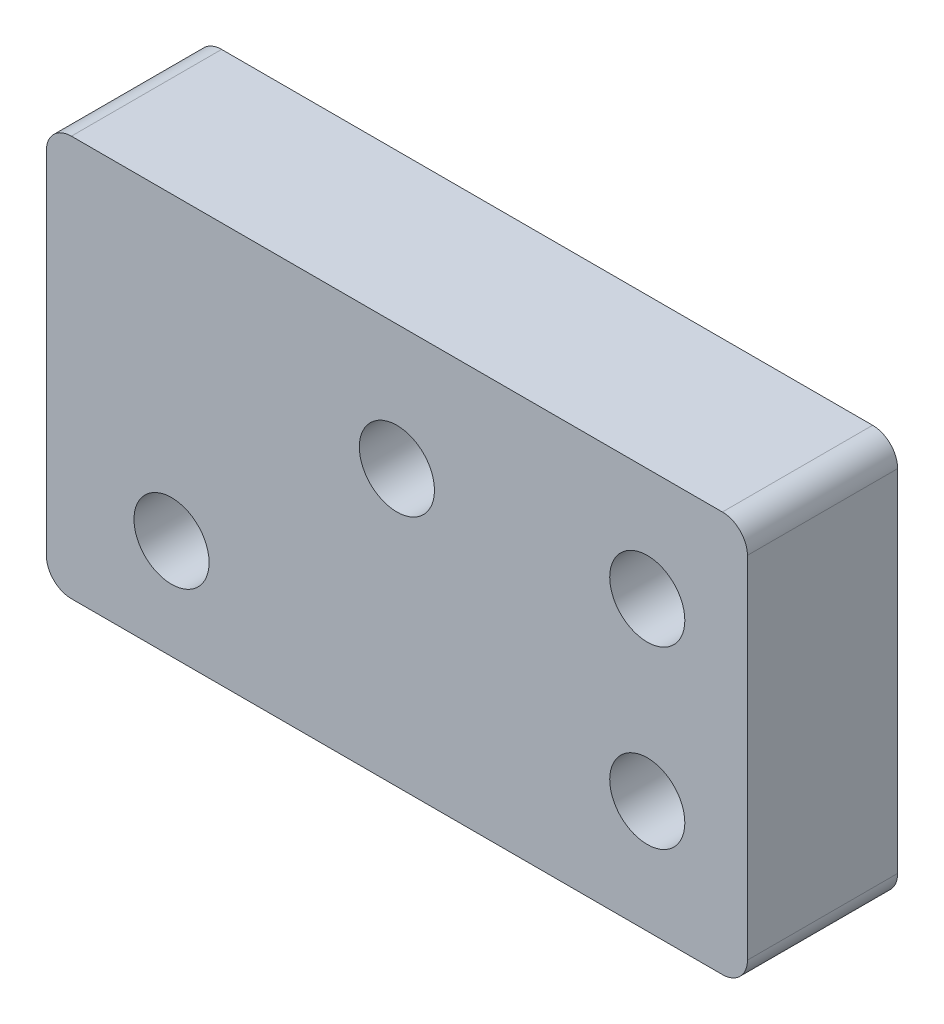
ISO-10303-21;
HEADER;
FILE_DESCRIPTION(('STEP AP214'),'2;1');
FILE_NAME('part.step','',(''),(''),'','','');
FILE_SCHEMA(('AUTOMOTIVE_DESIGN { 1 0 10303 214 1 1 1 1 }'));
ENDSEC;
DATA;
#1=APPLICATION_CONTEXT('core data for automotive mechanical design processes');
#2=APPLICATION_PROTOCOL_DEFINITION('international standard','automotive_design',2000,#1);
#3=PRODUCT_CONTEXT('',#1,'mechanical');
#4=PRODUCT('Part','Part','',(#3));
#5=PRODUCT_RELATED_PRODUCT_CATEGORY('part','',(#4));
#6=PRODUCT_DEFINITION_FORMATION('','',#4);
#7=PRODUCT_DEFINITION_CONTEXT('part definition',#1,'design');
#8=PRODUCT_DEFINITION('design','',#6,#7);
#9=PRODUCT_DEFINITION_SHAPE('','',#8);
#10=(LENGTH_UNIT() NAMED_UNIT(*) SI_UNIT(.MILLI.,.METRE.));
#11=(NAMED_UNIT(*) PLANE_ANGLE_UNIT() SI_UNIT($,.RADIAN.));
#12=(NAMED_UNIT(*) SI_UNIT($,.STERADIAN.) SOLID_ANGLE_UNIT());
#13=UNCERTAINTY_MEASURE_WITH_UNIT(LENGTH_MEASURE(1.E-05),#10,'distance_accuracy_value','');
#14=(GEOMETRIC_REPRESENTATION_CONTEXT(3) GLOBAL_UNCERTAINTY_ASSIGNED_CONTEXT((#13)) GLOBAL_UNIT_ASSIGNED_CONTEXT((#10,
#11,#12)) REPRESENTATION_CONTEXT('',''));
#15=CARTESIAN_POINT('',(0.,0.,0.));
#16=DIRECTION('',(0.,0.,1.));
#17=DIRECTION('',(1.,0.,0.));
#18=AXIS2_PLACEMENT_3D('',#15,#16,#17);
#19=CARTESIAN_POINT('',(-14.,-8.,6.));
#20=DIRECTION('',(1.,0.,0.));
#21=DIRECTION('',(0.,0.,-1.));
#22=AXIS2_PLACEMENT_3D('',#19,#20,#21);
#23=PLANE('',#22);
#24=DIRECTION('',(0.,-1.,0.));
#25=VECTOR('',#24,1.);
#26=CARTESIAN_POINT('',(-14.,-8.,6.));
#27=LINE('',#26,#25);
#28=CARTESIAN_POINT('',(-14.,7.,6.));
#29=VERTEX_POINT('',#28);
#30=CARTESIAN_POINT('',(-14.,-7.,6.));
#31=VERTEX_POINT('',#30);
#32=EDGE_CURVE('E123',#29,#31,#27,.T.);
#33=ORIENTED_EDGE('',*,*,#32,.F.);
#34=DIRECTION('',(0.,0.,-1.));
#35=VECTOR('',#34,1.);
#36=CARTESIAN_POINT('',(-14.,7.,6.));
#37=LINE('',#36,#35);
#38=CARTESIAN_POINT('',(-14.,7.,0.));
#39=VERTEX_POINT('',#38);
#40=EDGE_CURVE('E108',#29,#39,#37,.T.);
#41=ORIENTED_EDGE('',*,*,#40,.T.);
#42=DIRECTION('',(0.,-1.,0.));
#43=VECTOR('',#42,1.);
#44=CARTESIAN_POINT('',(-14.,-8.,0.));
#45=LINE('',#44,#43);
#46=CARTESIAN_POINT('',(-14.,-7.,0.));
#47=VERTEX_POINT('',#46);
#48=EDGE_CURVE('E120',#39,#47,#45,.T.);
#49=ORIENTED_EDGE('',*,*,#48,.T.);
#50=DIRECTION('',(0.,0.,-1.));
#51=VECTOR('',#50,1.);
#52=CARTESIAN_POINT('',(-14.,-7.,6.));
#53=LINE('',#52,#51);
#54=EDGE_CURVE('E126',#47,#31,#53,.F.);
#55=ORIENTED_EDGE('',*,*,#54,.T.);
#56=EDGE_LOOP('',(#33,#41,#49,#55));
#57=FACE_BOUND('',#56,.T.);
#58=ADVANCED_FACE('F36',(#57),#23,.F.);
#59=CARTESIAN_POINT('',(14.,-8.,6.));
#60=DIRECTION('',(0.,1.,0.));
#61=DIRECTION('',(-1.,0.,0.));
#62=AXIS2_PLACEMENT_3D('',#59,#60,#61);
#63=PLANE('',#62);
#64=DIRECTION('',(1.,0.,0.));
#65=VECTOR('',#64,1.);
#66=CARTESIAN_POINT('',(14.,-8.,6.));
#67=LINE('',#66,#65);
#68=CARTESIAN_POINT('',(-13.,-8.,6.));
#69=VERTEX_POINT('',#68);
#70=CARTESIAN_POINT('',(13.,-8.,6.));
#71=VERTEX_POINT('',#70);
#72=EDGE_CURVE('E208',#69,#71,#67,.T.);
#73=ORIENTED_EDGE('',*,*,#72,.F.);
#74=DIRECTION('',(0.,0.,-1.));
#75=VECTOR('',#74,1.);
#76=CARTESIAN_POINT('',(-13.,-8.,6.));
#77=LINE('',#76,#75);
#78=CARTESIAN_POINT('',(-13.,-8.,0.));
#79=VERTEX_POINT('',#78);
#80=EDGE_CURVE('E171',#69,#79,#77,.T.);
#81=ORIENTED_EDGE('',*,*,#80,.T.);
#82=DIRECTION('',(1.,0.,0.));
#83=VECTOR('',#82,1.);
#84=CARTESIAN_POINT('',(14.,-8.,0.));
#85=LINE('',#84,#83);
#86=CARTESIAN_POINT('',(13.,-8.,0.));
#87=VERTEX_POINT('',#86);
#88=EDGE_CURVE('E131',#79,#87,#85,.T.);
#89=ORIENTED_EDGE('',*,*,#88,.T.);
#90=DIRECTION('',(0.,0.,-1.));
#91=VECTOR('',#90,1.);
#92=CARTESIAN_POINT('',(13.,-8.,6.));
#93=LINE('',#92,#91);
#94=EDGE_CURVE('E169',#87,#71,#93,.F.);
#95=ORIENTED_EDGE('',*,*,#94,.T.);
#96=EDGE_LOOP('',(#73,#81,#89,#95));
#97=FACE_BOUND('',#96,.T.);
#98=ADVANCED_FACE('F227',(#97),#63,.F.);
#99=CARTESIAN_POINT('',(14.,-8.,6.));
#100=DIRECTION('',(-1.,0.,0.));
#101=DIRECTION('',(0.,0.,1.));
#102=AXIS2_PLACEMENT_3D('',#99,#100,#101);
#103=PLANE('',#102);
#104=DIRECTION('',(0.,1.,0.));
#105=VECTOR('',#104,1.);
#106=CARTESIAN_POINT('',(14.,-8.,6.));
#107=LINE('',#106,#105);
#108=CARTESIAN_POINT('',(14.,-7.,6.));
#109=VERTEX_POINT('',#108);
#110=CARTESIAN_POINT('',(14.,7.,6.));
#111=VERTEX_POINT('',#110);
#112=EDGE_CURVE('E210',#109,#111,#107,.T.);
#113=ORIENTED_EDGE('',*,*,#112,.F.);
#114=DIRECTION('',(0.,0.,-1.));
#115=VECTOR('',#114,1.);
#116=CARTESIAN_POINT('',(14.,-7.,6.));
#117=LINE('',#116,#115);
#118=CARTESIAN_POINT('',(14.,-7.,0.));
#119=VERTEX_POINT('',#118);
#120=EDGE_CURVE('E11',#109,#119,#117,.T.);
#121=ORIENTED_EDGE('',*,*,#120,.T.);
#122=DIRECTION('',(0.,1.,0.));
#123=VECTOR('',#122,1.);
#124=CARTESIAN_POINT('',(14.,-8.,0.));
#125=LINE('',#124,#123);
#126=CARTESIAN_POINT('',(14.,7.,0.));
#127=VERTEX_POINT('',#126);
#128=EDGE_CURVE('E138',#119,#127,#125,.T.);
#129=ORIENTED_EDGE('',*,*,#128,.T.);
#130=DIRECTION('',(0.,0.,-1.));
#131=VECTOR('',#130,1.);
#132=CARTESIAN_POINT('',(14.,7.,6.));
#133=LINE('',#132,#131);
#134=EDGE_CURVE('E45',#127,#111,#133,.F.);
#135=ORIENTED_EDGE('',*,*,#134,.T.);
#136=EDGE_LOOP('',(#113,#121,#129,#135));
#137=FACE_BOUND('',#136,.T.);
#138=ADVANCED_FACE('F220',(#137),#103,.F.);
#139=CARTESIAN_POINT('',(14.,8.,6.));
#140=DIRECTION('',(0.,-1.,0.));
#141=DIRECTION('',(1.,0.,0.));
#142=AXIS2_PLACEMENT_3D('',#139,#140,#141);
#143=PLANE('',#142);
#144=DIRECTION('',(-1.,0.,0.));
#145=VECTOR('',#144,1.);
#146=CARTESIAN_POINT('',(14.,8.,0.));
#147=LINE('',#146,#145);
#148=CARTESIAN_POINT('',(13.,8.,0.));
#149=VERTEX_POINT('',#148);
#150=CARTESIAN_POINT('',(-13.,8.,0.));
#151=VERTEX_POINT('',#150);
#152=EDGE_CURVE('E150',#149,#151,#147,.T.);
#153=ORIENTED_EDGE('',*,*,#152,.T.);
#154=DIRECTION('',(0.,0.,-1.));
#155=VECTOR('',#154,1.);
#156=CARTESIAN_POINT('',(-13.,8.,6.));
#157=LINE('',#156,#155);
#158=CARTESIAN_POINT('',(-13.,8.,6.));
#159=VERTEX_POINT('',#158);
#160=EDGE_CURVE('E109',#151,#159,#157,.F.);
#161=ORIENTED_EDGE('',*,*,#160,.T.);
#162=DIRECTION('',(-1.,0.,0.));
#163=VECTOR('',#162,1.);
#164=CARTESIAN_POINT('',(14.,8.,6.));
#165=LINE('',#164,#163);
#166=CARTESIAN_POINT('',(13.,8.,6.));
#167=VERTEX_POINT('',#166);
#168=EDGE_CURVE('E145',#167,#159,#165,.T.);
#169=ORIENTED_EDGE('',*,*,#168,.F.);
#170=DIRECTION('',(0.,0.,-1.));
#171=VECTOR('',#170,1.);
#172=CARTESIAN_POINT('',(13.,8.,6.));
#173=LINE('',#172,#171);
#174=EDGE_CURVE('E114',#167,#149,#173,.T.);
#175=ORIENTED_EDGE('',*,*,#174,.T.);
#176=EDGE_LOOP('',(#153,#161,#169,#175));
#177=FACE_BOUND('',#176,.T.);
#178=ADVANCED_FACE('F217',(#177),#143,.F.);
#179=CARTESIAN_POINT('',(0.,0.,6.));
#180=DIRECTION('',(0.,0.,1.));
#181=DIRECTION('',(1.,0.,0.));
#182=AXIS2_PLACEMENT_3D('',#179,#180,#181);
#183=PLANE('',#182);
#184=CARTESIAN_POINT('',(-9.,-4.,6.));
#185=DIRECTION('',(0.,0.,1.));
#186=DIRECTION('',(1.,0.,0.));
#187=AXIS2_PLACEMENT_3D('',#184,#185,#186);
#188=CIRCLE('',#187,1.5);
#189=CARTESIAN_POINT('',(-7.5,-4.,6.));
#190=VERTEX_POINT('',#189);
#191=EDGE_CURVE('E188',#190,#190,#188,.T.);
#192=ORIENTED_EDGE('',*,*,#191,.F.);
#193=EDGE_LOOP('',(#192));
#194=FACE_BOUND('',#193,.T.);
#195=CARTESIAN_POINT('',(0.,3.,6.));
#196=DIRECTION('',(0.,0.,1.));
#197=DIRECTION('',(1.,0.,0.));
#198=AXIS2_PLACEMENT_3D('',#195,#196,#197);
#199=CIRCLE('',#198,1.5);
#200=CARTESIAN_POINT('',(1.5,3.,6.));
#201=VERTEX_POINT('',#200);
#202=EDGE_CURVE('E177',#201,#201,#199,.T.);
#203=ORIENTED_EDGE('',*,*,#202,.F.);
#204=EDGE_LOOP('',(#203));
#205=FACE_BOUND('',#204,.T.);
#206=CARTESIAN_POINT('',(10.,-3.5,6.));
#207=DIRECTION('',(0.,0.,1.));
#208=DIRECTION('',(1.,0.,0.));
#209=AXIS2_PLACEMENT_3D('',#206,#207,#208);
#210=CIRCLE('',#209,1.5);
#211=CARTESIAN_POINT('',(11.5,-3.5,6.));
#212=VERTEX_POINT('',#211);
#213=EDGE_CURVE('E181',#212,#212,#210,.T.);
#214=ORIENTED_EDGE('',*,*,#213,.F.);
#215=EDGE_LOOP('',(#214));
#216=FACE_BOUND('',#215,.T.);
#217=CARTESIAN_POINT('',(10.,3.50000000000001,6.));
#218=DIRECTION('',(0.,0.,1.));
#219=DIRECTION('',(1.,0.,0.));
#220=AXIS2_PLACEMENT_3D('',#217,#218,#219);
#221=CIRCLE('',#220,1.5);
#222=CARTESIAN_POINT('',(11.5,3.50000000000001,6.));
#223=VERTEX_POINT('',#222);
#224=EDGE_CURVE('E196',#223,#223,#221,.T.);
#225=ORIENTED_EDGE('',*,*,#224,.F.);
#226=EDGE_LOOP('',(#225));
#227=FACE_BOUND('',#226,.T.);
#228=ORIENTED_EDGE('',*,*,#168,.T.);
#229=CARTESIAN_POINT('',(-13.,7.,6.));
#230=DIRECTION('',(0.,0.,1.));
#231=DIRECTION('',(1.,0.,0.));
#232=AXIS2_PLACEMENT_3D('',#229,#230,#231);
#233=CIRCLE('',#232,1.);
#234=EDGE_CURVE('E167',#159,#29,#233,.T.);
#235=ORIENTED_EDGE('',*,*,#234,.T.);
#236=ORIENTED_EDGE('',*,*,#32,.T.);
#237=CARTESIAN_POINT('',(-13.,-7.,6.));
#238=DIRECTION('',(0.,0.,1.));
#239=DIRECTION('',(1.,0.,0.));
#240=AXIS2_PLACEMENT_3D('',#237,#238,#239);
#241=CIRCLE('',#240,1.);
#242=EDGE_CURVE('E165',#31,#69,#241,.T.);
#243=ORIENTED_EDGE('',*,*,#242,.T.);
#244=ORIENTED_EDGE('',*,*,#72,.T.);
#245=CARTESIAN_POINT('',(13.,-7.,6.));
#246=DIRECTION('',(0.,0.,1.));
#247=DIRECTION('',(1.,0.,0.));
#248=AXIS2_PLACEMENT_3D('',#245,#246,#247);
#249=CIRCLE('',#248,1.);
#250=EDGE_CURVE('E59',#71,#109,#249,.T.);
#251=ORIENTED_EDGE('',*,*,#250,.T.);
#252=ORIENTED_EDGE('',*,*,#112,.T.);
#253=CARTESIAN_POINT('',(13.,7.,6.));
#254=DIRECTION('',(0.,0.,1.));
#255=DIRECTION('',(1.,0.,0.));
#256=AXIS2_PLACEMENT_3D('',#253,#254,#255);
#257=CIRCLE('',#256,1.);
#258=EDGE_CURVE('E161',#111,#167,#257,.T.);
#259=ORIENTED_EDGE('',*,*,#258,.T.);
#260=EDGE_LOOP('',(#228,#235,#236,#243,#244,#251,#252,#259));
#261=FACE_BOUND('',#260,.T.);
#262=ADVANCED_FACE('F214',(#194,#205,#216,#227,#261),#183,.T.);
#263=CARTESIAN_POINT('',(0.,0.,0.));
#264=DIRECTION('',(0.,0.,1.));
#265=DIRECTION('',(1.,0.,0.));
#266=AXIS2_PLACEMENT_3D('',#263,#264,#265);
#267=PLANE('',#266);
#268=CARTESIAN_POINT('',(-9.,-4.,0.));
#269=DIRECTION('',(0.,0.,1.));
#270=DIRECTION('',(1.,0.,0.));
#271=AXIS2_PLACEMENT_3D('',#268,#269,#270);
#272=CIRCLE('',#271,1.5);
#273=CARTESIAN_POINT('',(-7.5,-4.,0.));
#274=VERTEX_POINT('',#273);
#275=EDGE_CURVE('E40',#274,#274,#272,.T.);
#276=ORIENTED_EDGE('',*,*,#275,.T.);
#277=EDGE_LOOP('',(#276));
#278=FACE_BOUND('',#277,.T.);
#279=CARTESIAN_POINT('',(0.,3.,0.));
#280=DIRECTION('',(0.,0.,1.));
#281=DIRECTION('',(1.,0.,0.));
#282=AXIS2_PLACEMENT_3D('',#279,#280,#281);
#283=CIRCLE('',#282,1.5);
#284=CARTESIAN_POINT('',(1.5,3.,0.));
#285=VERTEX_POINT('',#284);
#286=EDGE_CURVE('E174',#285,#285,#283,.T.);
#287=ORIENTED_EDGE('',*,*,#286,.T.);
#288=EDGE_LOOP('',(#287));
#289=FACE_BOUND('',#288,.T.);
#290=CARTESIAN_POINT('',(10.,-3.5,0.));
#291=DIRECTION('',(0.,0.,-1.));
#292=DIRECTION('',(-1.,0.,0.));
#293=AXIS2_PLACEMENT_3D('',#290,#291,#292);
#294=CIRCLE('',#293,2.85);
#295=CARTESIAN_POINT('',(7.15,-3.5,0.));
#296=VERTEX_POINT('',#295);
#297=EDGE_CURVE('E199',#296,#296,#294,.T.);
#298=ORIENTED_EDGE('',*,*,#297,.F.);
#299=EDGE_LOOP('',(#298));
#300=FACE_BOUND('',#299,.T.);
#301=CARTESIAN_POINT('',(10.,3.50000000000001,0.));
#302=DIRECTION('',(0.,0.,-1.));
#303=DIRECTION('',(-1.,0.,0.));
#304=AXIS2_PLACEMENT_3D('',#301,#302,#303);
#305=CIRCLE('',#304,2.85);
#306=CARTESIAN_POINT('',(7.15,3.50000000000001,0.));
#307=VERTEX_POINT('',#306);
#308=EDGE_CURVE('E142',#307,#307,#305,.T.);
#309=ORIENTED_EDGE('',*,*,#308,.F.);
#310=EDGE_LOOP('',(#309));
#311=FACE_BOUND('',#310,.T.);
#312=ORIENTED_EDGE('',*,*,#48,.F.);
#313=CARTESIAN_POINT('',(-13.,7.,0.));
#314=DIRECTION('',(0.,0.,1.));
#315=DIRECTION('',(1.,0.,0.));
#316=AXIS2_PLACEMENT_3D('',#313,#314,#315);
#317=CIRCLE('',#316,1.);
#318=EDGE_CURVE('E104',#39,#151,#317,.F.);
#319=ORIENTED_EDGE('',*,*,#318,.T.);
#320=ORIENTED_EDGE('',*,*,#152,.F.);
#321=CARTESIAN_POINT('',(13.,7.,0.));
#322=DIRECTION('',(0.,0.,1.));
#323=DIRECTION('',(1.,0.,0.));
#324=AXIS2_PLACEMENT_3D('',#321,#322,#323);
#325=CIRCLE('',#324,1.);
#326=EDGE_CURVE('E125',#149,#127,#325,.F.);
#327=ORIENTED_EDGE('',*,*,#326,.T.);
#328=ORIENTED_EDGE('',*,*,#128,.F.);
#329=CARTESIAN_POINT('',(13.,-7.,0.));
#330=DIRECTION('',(0.,0.,1.));
#331=DIRECTION('',(1.,0.,0.));
#332=AXIS2_PLACEMENT_3D('',#329,#330,#331);
#333=CIRCLE('',#332,1.);
#334=EDGE_CURVE('E155',#119,#87,#333,.F.);
#335=ORIENTED_EDGE('',*,*,#334,.T.);
#336=ORIENTED_EDGE('',*,*,#88,.F.);
#337=CARTESIAN_POINT('',(-13.,-7.,0.));
#338=DIRECTION('',(0.,0.,1.));
#339=DIRECTION('',(1.,0.,0.));
#340=AXIS2_PLACEMENT_3D('',#337,#338,#339);
#341=CIRCLE('',#340,1.);
#342=EDGE_CURVE('E115',#79,#47,#341,.F.);
#343=ORIENTED_EDGE('',*,*,#342,.T.);
#344=EDGE_LOOP('',(#312,#319,#320,#327,#328,#335,#336,#343));
#345=FACE_BOUND('',#344,.T.);
#346=ADVANCED_FACE('F128',(#278,#289,#300,#311,#345),#267,.F.);
#347=CARTESIAN_POINT('',(10.,3.50000000000001,3.2));
#348=DIRECTION('',(0.,0.,-1.));
#349=DIRECTION('',(-1.,0.,0.));
#350=AXIS2_PLACEMENT_3D('',#347,#348,#349);
#351=CYLINDRICAL_SURFACE('',#350,2.85);
#352=CARTESIAN_POINT('',(10.,3.50000000000001,3.2));
#353=DIRECTION('',(0.,0.,-1.));
#354=DIRECTION('',(-1.,0.,0.));
#355=AXIS2_PLACEMENT_3D('',#352,#353,#354);
#356=CIRCLE('',#355,2.85);
#357=CARTESIAN_POINT('',(7.15,3.50000000000001,3.2));
#358=VERTEX_POINT('',#357);
#359=EDGE_CURVE('E132',#358,#358,#356,.T.);
#360=ORIENTED_EDGE('',*,*,#359,.F.);
#361=EDGE_LOOP('',(#360));
#362=FACE_BOUND('',#361,.T.);
#363=ORIENTED_EDGE('',*,*,#308,.T.);
#364=EDGE_LOOP('',(#363));
#365=FACE_BOUND('',#364,.T.);
#366=ADVANCED_FACE('F253',(#362,#365),#351,.F.);
#367=CARTESIAN_POINT('',(10.,3.50000000000001,3.2));
#368=DIRECTION('',(0.,0.,-1.));
#369=DIRECTION('',(-1.,0.,0.));
#370=AXIS2_PLACEMENT_3D('',#367,#368,#369);
#371=PLANE('',#370);
#372=CARTESIAN_POINT('',(10.,3.50000000000001,3.2));
#373=DIRECTION('',(0.,0.,-1.));
#374=DIRECTION('',(-1.,0.,0.));
#375=AXIS2_PLACEMENT_3D('',#372,#373,#374);
#376=CIRCLE('',#375,1.5);
#377=CARTESIAN_POINT('',(8.5,3.50000000000001,3.2));
#378=VERTEX_POINT('',#377);
#379=EDGE_CURVE('E193',#378,#378,#376,.T.);
#380=ORIENTED_EDGE('',*,*,#379,.F.);
#381=EDGE_LOOP('',(#380));
#382=FACE_BOUND('',#381,.T.);
#383=ORIENTED_EDGE('',*,*,#359,.T.);
#384=EDGE_LOOP('',(#383));
#385=FACE_BOUND('',#384,.T.);
#386=ADVANCED_FACE('F260',(#382,#385),#371,.T.);
#387=CARTESIAN_POINT('',(10.,-3.5,3.2));
#388=DIRECTION('',(0.,0.,-1.));
#389=DIRECTION('',(-1.,0.,0.));
#390=AXIS2_PLACEMENT_3D('',#387,#388,#389);
#391=CYLINDRICAL_SURFACE('',#390,2.85);
#392=CARTESIAN_POINT('',(10.,-3.5,3.2));
#393=DIRECTION('',(0.,0.,-1.));
#394=DIRECTION('',(-1.,0.,0.));
#395=AXIS2_PLACEMENT_3D('',#392,#393,#394);
#396=CIRCLE('',#395,2.85);
#397=CARTESIAN_POINT('',(7.15,-3.5,3.2));
#398=VERTEX_POINT('',#397);
#399=EDGE_CURVE('E200',#398,#398,#396,.T.);
#400=ORIENTED_EDGE('',*,*,#399,.F.);
#401=EDGE_LOOP('',(#400));
#402=FACE_BOUND('',#401,.T.);
#403=ORIENTED_EDGE('',*,*,#297,.T.);
#404=EDGE_LOOP('',(#403));
#405=FACE_BOUND('',#404,.T.);
#406=ADVANCED_FACE('F264',(#402,#405),#391,.F.);
#407=CARTESIAN_POINT('',(10.,-3.5,3.2));
#408=DIRECTION('',(0.,0.,-1.));
#409=DIRECTION('',(-1.,0.,0.));
#410=AXIS2_PLACEMENT_3D('',#407,#408,#409);
#411=PLANE('',#410);
#412=CARTESIAN_POINT('',(10.,-3.5,3.2));
#413=DIRECTION('',(0.,0.,-1.));
#414=DIRECTION('',(-1.,0.,0.));
#415=AXIS2_PLACEMENT_3D('',#412,#413,#414);
#416=CIRCLE('',#415,1.5);
#417=CARTESIAN_POINT('',(8.5,-3.5,3.2));
#418=VERTEX_POINT('',#417);
#419=EDGE_CURVE('E176',#418,#418,#416,.T.);
#420=ORIENTED_EDGE('',*,*,#419,.F.);
#421=EDGE_LOOP('',(#420));
#422=FACE_BOUND('',#421,.T.);
#423=ORIENTED_EDGE('',*,*,#399,.T.);
#424=EDGE_LOOP('',(#423));
#425=FACE_BOUND('',#424,.T.);
#426=ADVANCED_FACE('F268',(#422,#425),#411,.T.);
#427=CARTESIAN_POINT('',(10.,3.50000000000001,6.4));
#428=DIRECTION('',(0.,0.,-1.));
#429=DIRECTION('',(-1.,0.,0.));
#430=AXIS2_PLACEMENT_3D('',#427,#428,#429);
#431=CYLINDRICAL_SURFACE('',#430,1.5);
#432=ORIENTED_EDGE('',*,*,#224,.T.);
#433=EDGE_LOOP('',(#432));
#434=FACE_BOUND('',#433,.T.);
#435=ORIENTED_EDGE('',*,*,#379,.T.);
#436=EDGE_LOOP('',(#435));
#437=FACE_BOUND('',#436,.T.);
#438=ADVANCED_FACE('F272',(#434,#437),#431,.F.);
#439=CARTESIAN_POINT('',(10.,-3.5,6.4));
#440=DIRECTION('',(0.,0.,-1.));
#441=DIRECTION('',(-1.,0.,0.));
#442=AXIS2_PLACEMENT_3D('',#439,#440,#441);
#443=CYLINDRICAL_SURFACE('',#442,1.5);
#444=ORIENTED_EDGE('',*,*,#213,.T.);
#445=EDGE_LOOP('',(#444));
#446=FACE_BOUND('',#445,.T.);
#447=ORIENTED_EDGE('',*,*,#419,.T.);
#448=EDGE_LOOP('',(#447));
#449=FACE_BOUND('',#448,.T.);
#450=ADVANCED_FACE('F238',(#446,#449),#443,.F.);
#451=CARTESIAN_POINT('',(-13.,7.,6.));
#452=DIRECTION('',(0.,0.,-1.));
#453=DIRECTION('',(-1.,0.,0.));
#454=AXIS2_PLACEMENT_3D('',#451,#452,#453);
#455=CYLINDRICAL_SURFACE('',#454,1.);
#456=ORIENTED_EDGE('',*,*,#234,.F.);
#457=ORIENTED_EDGE('',*,*,#160,.F.);
#458=ORIENTED_EDGE('',*,*,#318,.F.);
#459=ORIENTED_EDGE('',*,*,#40,.F.);
#460=EDGE_LOOP('',(#456,#457,#458,#459));
#461=FACE_BOUND('',#460,.T.);
#462=ADVANCED_FACE('F107',(#461),#455,.T.);
#463=CARTESIAN_POINT('',(-13.,-7.,6.));
#464=DIRECTION('',(0.,0.,-1.));
#465=DIRECTION('',(-1.,0.,0.));
#466=AXIS2_PLACEMENT_3D('',#463,#464,#465);
#467=CYLINDRICAL_SURFACE('',#466,1.);
#468=ORIENTED_EDGE('',*,*,#242,.F.);
#469=ORIENTED_EDGE('',*,*,#54,.F.);
#470=ORIENTED_EDGE('',*,*,#342,.F.);
#471=ORIENTED_EDGE('',*,*,#80,.F.);
#472=EDGE_LOOP('',(#468,#469,#470,#471));
#473=FACE_BOUND('',#472,.T.);
#474=ADVANCED_FACE('F231',(#473),#467,.T.);
#475=CARTESIAN_POINT('',(13.,-7.,6.));
#476=DIRECTION('',(0.,0.,-1.));
#477=DIRECTION('',(-1.,0.,0.));
#478=AXIS2_PLACEMENT_3D('',#475,#476,#477);
#479=CYLINDRICAL_SURFACE('',#478,1.);
#480=ORIENTED_EDGE('',*,*,#250,.F.);
#481=ORIENTED_EDGE('',*,*,#94,.F.);
#482=ORIENTED_EDGE('',*,*,#334,.F.);
#483=ORIENTED_EDGE('',*,*,#120,.F.);
#484=EDGE_LOOP('',(#480,#481,#482,#483));
#485=FACE_BOUND('',#484,.T.);
#486=ADVANCED_FACE('F223',(#485),#479,.T.);
#487=CARTESIAN_POINT('',(13.,7.,6.));
#488=DIRECTION('',(0.,0.,-1.));
#489=DIRECTION('',(-1.,0.,0.));
#490=AXIS2_PLACEMENT_3D('',#487,#488,#489);
#491=CYLINDRICAL_SURFACE('',#490,1.);
#492=ORIENTED_EDGE('',*,*,#258,.F.);
#493=ORIENTED_EDGE('',*,*,#134,.F.);
#494=ORIENTED_EDGE('',*,*,#326,.F.);
#495=ORIENTED_EDGE('',*,*,#174,.F.);
#496=EDGE_LOOP('',(#492,#493,#494,#495));
#497=FACE_BOUND('',#496,.T.);
#498=ADVANCED_FACE('F38',(#497),#491,.T.);
#499=CARTESIAN_POINT('',(0.,3.,-4.));
#500=DIRECTION('',(0.,0.,1.));
#501=DIRECTION('',(1.,0.,0.));
#502=AXIS2_PLACEMENT_3D('',#499,#500,#501);
#503=CYLINDRICAL_SURFACE('',#502,1.5);
#504=ORIENTED_EDGE('',*,*,#202,.T.);
#505=EDGE_LOOP('',(#504));
#506=FACE_BOUND('',#505,.T.);
#507=ORIENTED_EDGE('',*,*,#286,.F.);
#508=EDGE_LOOP('',(#507));
#509=FACE_BOUND('',#508,.T.);
#510=ADVANCED_FACE('F280',(#506,#509),#503,.F.);
#511=CARTESIAN_POINT('',(-9.,-4.,-4.));
#512=DIRECTION('',(0.,0.,1.));
#513=DIRECTION('',(1.,0.,0.));
#514=AXIS2_PLACEMENT_3D('',#511,#512,#513);
#515=CYLINDRICAL_SURFACE('',#514,1.5);
#516=ORIENTED_EDGE('',*,*,#191,.T.);
#517=EDGE_LOOP('',(#516));
#518=FACE_BOUND('',#517,.T.);
#519=ORIENTED_EDGE('',*,*,#275,.F.);
#520=EDGE_LOOP('',(#519));
#521=FACE_BOUND('',#520,.T.);
#522=ADVANCED_FACE('F283',(#518,#521),#515,.F.);
#523=CLOSED_SHELL('',(#58,#98,#138,#178,#262,#346,#366,#386,#406,#426,#438,#450,#462,#474,#486,
#498,#510,#522));
#524=MANIFOLD_SOLID_BREP('B2',#523);
#525=ADVANCED_BREP_SHAPE_REPRESENTATION('',(#18,#524),#14);
#526=SHAPE_DEFINITION_REPRESENTATION(#9,#525);
ENDSEC;
END-ISO-10303-21;
